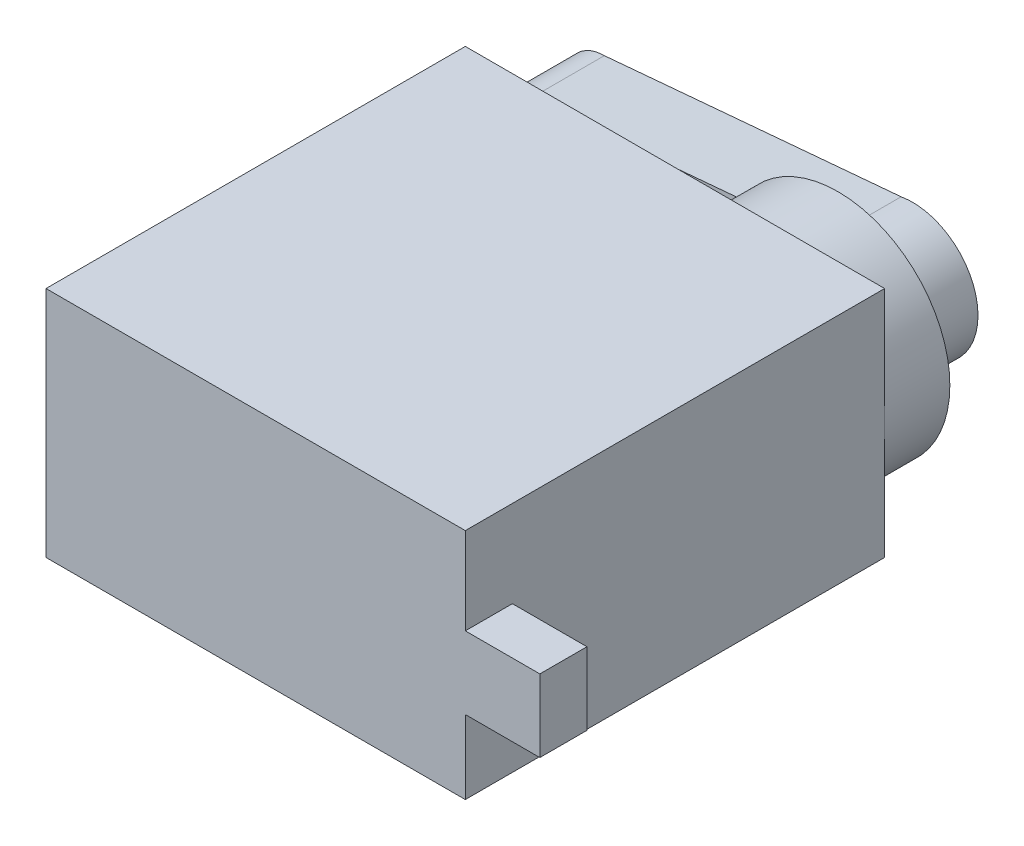
ISO-10303-21;
HEADER;
FILE_DESCRIPTION(('STEP AP214'),'2;1');
FILE_NAME('part.step','',(''),(''),'','','');
FILE_SCHEMA(('AUTOMOTIVE_DESIGN { 1 0 10303 214 1 1 1 1 }'));
ENDSEC;
DATA;
#1=APPLICATION_CONTEXT('core data for automotive mechanical design processes');
#2=APPLICATION_PROTOCOL_DEFINITION('international standard','automotive_design',2000,#1);
#3=PRODUCT_CONTEXT('',#1,'mechanical');
#4=PRODUCT('Part','Part','',(#3));
#5=PRODUCT_RELATED_PRODUCT_CATEGORY('part','',(#4));
#6=PRODUCT_DEFINITION_FORMATION('','',#4);
#7=PRODUCT_DEFINITION_CONTEXT('part definition',#1,'design');
#8=PRODUCT_DEFINITION('design','',#6,#7);
#9=PRODUCT_DEFINITION_SHAPE('','',#8);
#10=(LENGTH_UNIT() NAMED_UNIT(*) SI_UNIT(.MILLI.,.METRE.));
#11=(NAMED_UNIT(*) PLANE_ANGLE_UNIT() SI_UNIT($,.RADIAN.));
#12=(NAMED_UNIT(*) SI_UNIT($,.STERADIAN.) SOLID_ANGLE_UNIT());
#13=UNCERTAINTY_MEASURE_WITH_UNIT(LENGTH_MEASURE(1.E-05),#10,'distance_accuracy_value','');
#14=(GEOMETRIC_REPRESENTATION_CONTEXT(3) GLOBAL_UNCERTAINTY_ASSIGNED_CONTEXT((#13)) GLOBAL_UNIT_ASSIGNED_CONTEXT((#10,
#11,#12)) REPRESENTATION_CONTEXT('',''));
#15=CARTESIAN_POINT('',(0.,0.,0.));
#16=DIRECTION('',(0.,0.,1.));
#17=DIRECTION('',(1.,0.,0.));
#18=AXIS2_PLACEMENT_3D('',#15,#16,#17);
#19=CARTESIAN_POINT('',(11.25,6.25,22.5));
#20=DIRECTION('',(-1.,0.,0.));
#21=DIRECTION('',(0.,-1.,0.));
#22=AXIS2_PLACEMENT_3D('',#19,#20,#21);
#23=PLANE('',#22);
#24=DIRECTION('',(0.,0.,-1.));
#25=VECTOR('',#24,1.);
#26=CARTESIAN_POINT('',(11.25,-2.29734072769361,22.5));
#27=LINE('',#26,#25);
#28=CARTESIAN_POINT('',(11.25,-2.29734072769361,22.5));
#29=VERTEX_POINT('',#28);
#30=CARTESIAN_POINT('',(11.25,-2.29734072769361,19.9739061693691));
#31=VERTEX_POINT('',#30);
#32=EDGE_CURVE('E246',#29,#31,#27,.T.);
#33=ORIENTED_EDGE('',*,*,#32,.F.);
#34=DIRECTION('',(0.,1.,0.));
#35=VECTOR('',#34,1.);
#36=CARTESIAN_POINT('',(11.25,6.25,22.5));
#37=LINE('',#36,#35);
#38=CARTESIAN_POINT('',(11.25,-6.25,22.5));
#39=VERTEX_POINT('',#38);
#40=EDGE_CURVE('E155',#39,#29,#37,.T.);
#41=ORIENTED_EDGE('',*,*,#40,.F.);
#42=DIRECTION('',(0.,0.,-1.));
#43=VECTOR('',#42,1.);
#44=CARTESIAN_POINT('',(11.25,-6.25,22.5));
#45=LINE('',#44,#43);
#46=CARTESIAN_POINT('',(11.25,-6.25,0.));
#47=VERTEX_POINT('',#46);
#48=EDGE_CURVE('E205',#39,#47,#45,.T.);
#49=ORIENTED_EDGE('',*,*,#48,.T.);
#50=DIRECTION('',(0.,1.,0.));
#51=VECTOR('',#50,1.);
#52=CARTESIAN_POINT('',(11.25,6.25,0.));
#53=LINE('',#52,#51);
#54=CARTESIAN_POINT('',(11.25,0.,0.));
#55=VERTEX_POINT('',#54);
#56=EDGE_CURVE('E206',#47,#55,#53,.T.);
#57=ORIENTED_EDGE('',*,*,#56,.T.);
#58=CARTESIAN_POINT('',(11.25,6.25,0.));
#59=VERTEX_POINT('',#58);
#60=EDGE_CURVE('E193',#55,#59,#53,.T.);
#61=ORIENTED_EDGE('',*,*,#60,.T.);
#62=DIRECTION('',(0.,0.,-1.));
#63=VECTOR('',#62,1.);
#64=CARTESIAN_POINT('',(11.25,6.25,22.5));
#65=LINE('',#64,#63);
#66=CARTESIAN_POINT('',(11.25,6.25,22.5));
#67=VERTEX_POINT('',#66);
#68=EDGE_CURVE('E37',#67,#59,#65,.T.);
#69=ORIENTED_EDGE('',*,*,#68,.F.);
#70=CARTESIAN_POINT('',(11.25,1.59067430024606,22.5));
#71=VERTEX_POINT('',#70);
#72=EDGE_CURVE('E199',#71,#67,#37,.T.);
#73=ORIENTED_EDGE('',*,*,#72,.F.);
#74=DIRECTION('',(0.,0.,1.));
#75=VECTOR('',#74,1.);
#76=CARTESIAN_POINT('',(11.25,1.59067430024606,22.5));
#77=LINE('',#76,#75);
#78=CARTESIAN_POINT('',(11.25,1.59067430024606,19.9739061693691));
#79=VERTEX_POINT('',#78);
#80=EDGE_CURVE('E150',#79,#71,#77,.T.);
#81=ORIENTED_EDGE('',*,*,#80,.F.);
#82=DIRECTION('',(0.,1.,0.));
#83=VECTOR('',#82,1.);
#84=CARTESIAN_POINT('',(11.25,1.59067430024606,19.9739061693691));
#85=LINE('',#84,#83);
#86=EDGE_CURVE('E247',#31,#79,#85,.T.);
#87=ORIENTED_EDGE('',*,*,#86,.F.);
#88=EDGE_LOOP('',(#33,#41,#49,#57,#61,#69,#73,#81,#87));
#89=FACE_BOUND('',#88,.T.);
#90=ADVANCED_FACE('F34',(#89),#23,.F.);
#91=CARTESIAN_POINT('',(-11.25,6.25,22.5));
#92=DIRECTION('',(0.,-1.,0.));
#93=DIRECTION('',(0.,0.,-1.));
#94=AXIS2_PLACEMENT_3D('',#91,#92,#93);
#95=PLANE('',#94);
#96=DIRECTION('',(-1.,0.,0.));
#97=VECTOR('',#96,1.);
#98=CARTESIAN_POINT('',(-11.25,6.25,0.));
#99=LINE('',#98,#97);
#100=CARTESIAN_POINT('',(-11.25,6.25,0.));
#101=VERTEX_POINT('',#100);
#102=EDGE_CURVE('E208',#59,#101,#99,.T.);
#103=ORIENTED_EDGE('',*,*,#102,.T.);
#104=DIRECTION('',(0.,0.,-1.));
#105=VECTOR('',#104,1.);
#106=CARTESIAN_POINT('',(-11.25,6.25,22.5));
#107=LINE('',#106,#105);
#108=CARTESIAN_POINT('',(-11.25,6.25,22.5));
#109=VERTEX_POINT('',#108);
#110=EDGE_CURVE('E218',#109,#101,#107,.T.);
#111=ORIENTED_EDGE('',*,*,#110,.F.);
#112=DIRECTION('',(-1.,0.,0.));
#113=VECTOR('',#112,1.);
#114=CARTESIAN_POINT('',(-11.25,6.25,22.5));
#115=LINE('',#114,#113);
#116=EDGE_CURVE('E198',#67,#109,#115,.T.);
#117=ORIENTED_EDGE('',*,*,#116,.F.);
#118=ORIENTED_EDGE('',*,*,#68,.T.);
#119=EDGE_LOOP('',(#103,#111,#117,#118));
#120=FACE_BOUND('',#119,.T.);
#121=ADVANCED_FACE('F228',(#120),#95,.F.);
#122=CARTESIAN_POINT('',(-11.25,6.25,22.5));
#123=DIRECTION('',(1.,0.,0.));
#124=DIRECTION('',(0.,1.,0.));
#125=AXIS2_PLACEMENT_3D('',#122,#123,#124);
#126=PLANE('',#125);
#127=DIRECTION('',(0.,-1.,0.));
#128=VECTOR('',#127,1.);
#129=CARTESIAN_POINT('',(-11.25,6.25,0.));
#130=LINE('',#129,#128);
#131=CARTESIAN_POINT('',(-11.25,-6.25,0.));
#132=VERTEX_POINT('',#131);
#133=EDGE_CURVE('E210',#101,#132,#130,.T.);
#134=ORIENTED_EDGE('',*,*,#133,.T.);
#135=DIRECTION('',(0.,0.,-1.));
#136=VECTOR('',#135,1.);
#137=CARTESIAN_POINT('',(-11.25,-6.25,22.5));
#138=LINE('',#137,#136);
#139=CARTESIAN_POINT('',(-11.25,-6.25,22.5));
#140=VERTEX_POINT('',#139);
#141=EDGE_CURVE('E216',#140,#132,#138,.T.);
#142=ORIENTED_EDGE('',*,*,#141,.F.);
#143=DIRECTION('',(0.,-1.,0.));
#144=VECTOR('',#143,1.);
#145=CARTESIAN_POINT('',(-11.25,6.25,22.5));
#146=LINE('',#145,#144);
#147=EDGE_CURVE('E201',#109,#140,#146,.T.);
#148=ORIENTED_EDGE('',*,*,#147,.F.);
#149=ORIENTED_EDGE('',*,*,#110,.T.);
#150=EDGE_LOOP('',(#134,#142,#148,#149));
#151=FACE_BOUND('',#150,.T.);
#152=ADVANCED_FACE('F240',(#151),#126,.F.);
#153=CARTESIAN_POINT('',(-11.25,-6.25,22.5));
#154=DIRECTION('',(0.,1.,0.));
#155=DIRECTION('',(0.,0.,1.));
#156=AXIS2_PLACEMENT_3D('',#153,#154,#155);
#157=PLANE('',#156);
#158=DIRECTION('',(1.,0.,0.));
#159=VECTOR('',#158,1.);
#160=CARTESIAN_POINT('',(-11.25,-6.25,0.));
#161=LINE('',#160,#159);
#162=EDGE_CURVE('E212',#132,#47,#161,.T.);
#163=ORIENTED_EDGE('',*,*,#162,.T.);
#164=ORIENTED_EDGE('',*,*,#48,.F.);
#165=DIRECTION('',(1.,0.,0.));
#166=VECTOR('',#165,1.);
#167=CARTESIAN_POINT('',(-11.25,-6.25,22.5));
#168=LINE('',#167,#166);
#169=EDGE_CURVE('E203',#140,#39,#168,.T.);
#170=ORIENTED_EDGE('',*,*,#169,.F.);
#171=ORIENTED_EDGE('',*,*,#141,.T.);
#172=EDGE_LOOP('',(#163,#164,#170,#171));
#173=FACE_BOUND('',#172,.T.);
#174=ADVANCED_FACE('F243',(#173),#157,.F.);
#175=CARTESIAN_POINT('',(0.,0.,22.5));
#176=DIRECTION('',(0.,0.,1.));
#177=DIRECTION('',(1.,0.,0.));
#178=AXIS2_PLACEMENT_3D('',#175,#176,#177);
#179=PLANE('',#178);
#180=ORIENTED_EDGE('',*,*,#40,.T.);
#181=DIRECTION('',(-1.,0.,0.));
#182=VECTOR('',#181,1.);
#183=CARTESIAN_POINT('',(15.25,-2.29734072769361,22.5));
#184=LINE('',#183,#182);
#185=CARTESIAN_POINT('',(15.25,-2.29734072769361,22.5));
#186=VERTEX_POINT('',#185);
#187=EDGE_CURVE('E138',#186,#29,#184,.T.);
#188=ORIENTED_EDGE('',*,*,#187,.F.);
#189=DIRECTION('',(0.,-1.,0.));
#190=VECTOR('',#189,1.);
#191=CARTESIAN_POINT('',(15.25,1.59067430024606,22.5));
#192=LINE('',#191,#190);
#193=CARTESIAN_POINT('',(15.25,1.59067430024606,22.5));
#194=VERTEX_POINT('',#193);
#195=EDGE_CURVE('E145',#194,#186,#192,.T.);
#196=ORIENTED_EDGE('',*,*,#195,.F.);
#197=DIRECTION('',(-1.,0.,0.));
#198=VECTOR('',#197,1.);
#199=CARTESIAN_POINT('',(15.25,1.59067430024606,22.5));
#200=LINE('',#199,#198);
#201=EDGE_CURVE('E50',#194,#71,#200,.T.);
#202=ORIENTED_EDGE('',*,*,#201,.T.);
#203=ORIENTED_EDGE('',*,*,#72,.T.);
#204=ORIENTED_EDGE('',*,*,#116,.T.);
#205=ORIENTED_EDGE('',*,*,#147,.T.);
#206=ORIENTED_EDGE('',*,*,#169,.T.);
#207=EDGE_LOOP('',(#180,#188,#196,#202,#203,#204,#205,#206));
#208=FACE_BOUND('',#207,.T.);
#209=ADVANCED_FACE('F153',(#208),#179,.T.);
#210=CARTESIAN_POINT('',(0.,0.,0.));
#211=DIRECTION('',(0.,0.,1.));
#212=DIRECTION('',(1.,0.,0.));
#213=AXIS2_PLACEMENT_3D('',#210,#211,#212);
#214=PLANE('',#213);
#215=ORIENTED_EDGE('',*,*,#60,.F.);
#216=CARTESIAN_POINT('',(5.25,0.,0.));
#217=DIRECTION('',(0.,0.,-1.));
#218=DIRECTION('',(-1.,0.,0.));
#219=AXIS2_PLACEMENT_3D('',#216,#217,#218);
#220=CIRCLE('',#219,6.);
#221=EDGE_CURVE('E190',#55,#55,#220,.T.);
#222=ORIENTED_EDGE('',*,*,#221,.F.);
#223=ORIENTED_EDGE('',*,*,#56,.F.);
#224=ORIENTED_EDGE('',*,*,#162,.F.);
#225=ORIENTED_EDGE('',*,*,#133,.F.);
#226=ORIENTED_EDGE('',*,*,#102,.F.);
#227=EDGE_LOOP('',(#215,#222,#223,#224,#225,#226));
#228=FACE_BOUND('',#227,.T.);
#229=ADVANCED_FACE('F237',(#228),#214,.F.);
#230=CARTESIAN_POINT('',(5.25,0.,-3.5));
#231=DIRECTION('',(0.,0.,1.));
#232=DIRECTION('',(1.,0.,0.));
#233=AXIS2_PLACEMENT_3D('',#230,#231,#232);
#234=CYLINDRICAL_SURFACE('',#233,6.);
#235=CARTESIAN_POINT('',(5.25,0.,-3.5));
#236=DIRECTION('',(0.,0.,-1.));
#237=DIRECTION('',(-1.,0.,0.));
#238=AXIS2_PLACEMENT_3D('',#235,#236,#237);
#239=CIRCLE('',#238,6.);
#240=CARTESIAN_POINT('',(0.0854735122375189,3.0541228130512,-3.5));
#241=VERTEX_POINT('',#240);
#242=CARTESIAN_POINT('',(0.085473512237518,-3.0541228130512,-3.5));
#243=VERTEX_POINT('',#242);
#244=EDGE_CURVE('E191',#241,#243,#239,.T.);
#245=ORIENTED_EDGE('',*,*,#244,.F.);
#246=EDGE_CURVE('E194',#243,#241,#239,.T.);
#247=ORIENTED_EDGE('',*,*,#246,.F.);
#248=EDGE_LOOP('',(#245,#247));
#249=FACE_BOUND('',#248,.T.);
#250=ORIENTED_EDGE('',*,*,#221,.T.);
#251=EDGE_LOOP('',(#250));
#252=FACE_BOUND('',#251,.T.);
#253=ADVANCED_FACE('F282',(#249,#252),#234,.T.);
#254=CARTESIAN_POINT('',(0.,0.,-3.5));
#255=DIRECTION('',(0.,0.,-1.));
#256=DIRECTION('',(-1.,0.,0.));
#257=AXIS2_PLACEMENT_3D('',#254,#255,#256);
#258=PLANE('',#257);
#259=DIRECTION('',(-0.996126747672036,0.0879289632165159,0.));
#260=VECTOR('',#259,1.);
#261=CARTESIAN_POINT('',(-11.29,-2.05,-3.5));
#262=LINE('',#261,#260);
#263=CARTESIAN_POINT('',(4.63512948707161,-3.45572485194223,-3.5));
#264=VERTEX_POINT('',#263);
#265=EDGE_CURVE('E58',#264,#243,#262,.T.);
#266=ORIENTED_EDGE('',*,*,#265,.F.);
#267=CARTESIAN_POINT('',(5.25,0.,-3.5));
#268=DIRECTION('',(0.,0.,-1.));
#269=DIRECTION('',(-1.,0.,0.));
#270=AXIS2_PLACEMENT_3D('',#267,#268,#269);
#271=CIRCLE('',#270,3.51);
#272=CARTESIAN_POINT('',(4.6351294870716,3.45572485194223,-3.5));
#273=VERTEX_POINT('',#272);
#274=EDGE_CURVE('E175',#273,#264,#271,.T.);
#275=ORIENTED_EDGE('',*,*,#274,.F.);
#276=DIRECTION('',(0.996126747672036,0.0879289632165159,0.));
#277=VECTOR('',#276,1.);
#278=CARTESIAN_POINT('',(4.6351294870716,3.45572485194223,-3.5));
#279=LINE('',#278,#277);
#280=EDGE_CURVE('E11',#241,#273,#279,.T.);
#281=ORIENTED_EDGE('',*,*,#280,.F.);
#282=ORIENTED_EDGE('',*,*,#244,.T.);
#283=EDGE_LOOP('',(#266,#275,#281,#282));
#284=FACE_BOUND('',#283,.T.);
#285=ADVANCED_FACE('F287',(#284),#258,.T.);
#286=CARTESIAN_POINT('',(-11.29,0.,-3.5));
#287=DIRECTION('',(0.,0.,-1.));
#288=DIRECTION('',(-1.,0.,0.));
#289=AXIS2_PLACEMENT_3D('',#286,#287,#288);
#290=PLANE('',#289);
#291=CARTESIAN_POINT('',(-11.29,-2.05,-3.5));
#292=VERTEX_POINT('',#291);
#293=EDGE_CURVE('E177',#243,#292,#262,.T.);
#294=ORIENTED_EDGE('',*,*,#293,.F.);
#295=ORIENTED_EDGE('',*,*,#246,.T.);
#296=CARTESIAN_POINT('',(-11.29,2.05,-3.5));
#297=VERTEX_POINT('',#296);
#298=EDGE_CURVE('E43',#297,#241,#279,.T.);
#299=ORIENTED_EDGE('',*,*,#298,.F.);
#300=CARTESIAN_POINT('',(-11.29,0.,-3.5));
#301=DIRECTION('',(0.,0.,-1.));
#302=DIRECTION('',(-1.,0.,0.));
#303=AXIS2_PLACEMENT_3D('',#300,#301,#302);
#304=CIRCLE('',#303,2.05);
#305=EDGE_CURVE('E156',#292,#297,#304,.T.);
#306=ORIENTED_EDGE('',*,*,#305,.F.);
#307=EDGE_LOOP('',(#294,#295,#299,#306));
#308=FACE_BOUND('',#307,.T.);
#309=ADVANCED_FACE('F291',(#308),#290,.F.);
#310=CARTESIAN_POINT('',(-11.29,0.,-7.5));
#311=DIRECTION('',(0.,0.,1.));
#312=DIRECTION('',(1.,0.,0.));
#313=AXIS2_PLACEMENT_3D('',#310,#311,#312);
#314=CYLINDRICAL_SURFACE('',#313,2.05);
#315=ORIENTED_EDGE('',*,*,#305,.T.);
#316=DIRECTION('',(0.,0.,1.));
#317=VECTOR('',#316,1.);
#318=CARTESIAN_POINT('',(-11.29,2.05,-7.5));
#319=LINE('',#318,#317);
#320=CARTESIAN_POINT('',(-11.29,2.05,-7.5));
#321=VERTEX_POINT('',#320);
#322=EDGE_CURVE('E187',#321,#297,#319,.T.);
#323=ORIENTED_EDGE('',*,*,#322,.F.);
#324=CARTESIAN_POINT('',(-11.29,0.,-7.5));
#325=DIRECTION('',(0.,0.,-1.));
#326=DIRECTION('',(-1.,0.,0.));
#327=AXIS2_PLACEMENT_3D('',#324,#325,#326);
#328=CIRCLE('',#327,2.05);
#329=CARTESIAN_POINT('',(-11.29,-2.05,-7.5));
#330=VERTEX_POINT('',#329);
#331=EDGE_CURVE('E164',#330,#321,#328,.T.);
#332=ORIENTED_EDGE('',*,*,#331,.F.);
#333=DIRECTION('',(0.,0.,1.));
#334=VECTOR('',#333,1.);
#335=CARTESIAN_POINT('',(-11.29,-2.05,-7.5));
#336=LINE('',#335,#334);
#337=EDGE_CURVE('E172',#330,#292,#336,.T.);
#338=ORIENTED_EDGE('',*,*,#337,.T.);
#339=EDGE_LOOP('',(#315,#323,#332,#338));
#340=FACE_BOUND('',#339,.T.);
#341=ADVANCED_FACE('F292',(#340),#314,.T.);
#342=CARTESIAN_POINT('',(4.6351294870716,3.45572485194223,-7.5));
#343=DIRECTION('',(0.0879289632165158,-0.996126747672036,0.));
#344=DIRECTION('',(0.996126747672036,0.0879289632165158,0.));
#345=AXIS2_PLACEMENT_3D('',#342,#343,#344);
#346=PLANE('',#345);
#347=ORIENTED_EDGE('',*,*,#298,.T.);
#348=ORIENTED_EDGE('',*,*,#280,.T.);
#349=DIRECTION('',(0.,0.,1.));
#350=VECTOR('',#349,1.);
#351=CARTESIAN_POINT('',(4.6351294870716,3.45572485194223,-7.5));
#352=LINE('',#351,#350);
#353=CARTESIAN_POINT('',(4.6351294870716,3.45572485194223,-7.5));
#354=VERTEX_POINT('',#353);
#355=EDGE_CURVE('E184',#354,#273,#352,.T.);
#356=ORIENTED_EDGE('',*,*,#355,.F.);
#357=DIRECTION('',(0.996126747672036,0.0879289632165159,0.));
#358=VECTOR('',#357,1.);
#359=CARTESIAN_POINT('',(4.6351294870716,3.45572485194223,-7.5));
#360=LINE('',#359,#358);
#361=EDGE_CURVE('E167',#321,#354,#360,.T.);
#362=ORIENTED_EDGE('',*,*,#361,.F.);
#363=ORIENTED_EDGE('',*,*,#322,.T.);
#364=EDGE_LOOP('',(#347,#348,#356,#362,#363));
#365=FACE_BOUND('',#364,.T.);
#366=ADVANCED_FACE('F295',(#365),#346,.F.);
#367=CARTESIAN_POINT('',(5.25,0.,-7.5));
#368=DIRECTION('',(0.,0.,1.));
#369=DIRECTION('',(1.,0.,0.));
#370=AXIS2_PLACEMENT_3D('',#367,#368,#369);
#371=CYLINDRICAL_SURFACE('',#370,3.51);
#372=ORIENTED_EDGE('',*,*,#274,.T.);
#373=DIRECTION('',(0.,0.,1.));
#374=VECTOR('',#373,1.);
#375=CARTESIAN_POINT('',(4.63512948707161,-3.45572485194223,-7.5));
#376=LINE('',#375,#374);
#377=CARTESIAN_POINT('',(4.63512948707161,-3.45572485194223,-7.5));
#378=VERTEX_POINT('',#377);
#379=EDGE_CURVE('E181',#378,#264,#376,.T.);
#380=ORIENTED_EDGE('',*,*,#379,.F.);
#381=CARTESIAN_POINT('',(5.25,0.,-7.5));
#382=DIRECTION('',(0.,0.,-1.));
#383=DIRECTION('',(-1.,0.,0.));
#384=AXIS2_PLACEMENT_3D('',#381,#382,#383);
#385=CIRCLE('',#384,3.51);
#386=EDGE_CURVE('E169',#354,#378,#385,.T.);
#387=ORIENTED_EDGE('',*,*,#386,.F.);
#388=ORIENTED_EDGE('',*,*,#355,.T.);
#389=EDGE_LOOP('',(#372,#380,#387,#388));
#390=FACE_BOUND('',#389,.T.);
#391=ADVANCED_FACE('F299',(#390),#371,.T.);
#392=CARTESIAN_POINT('',(-11.29,-2.05,-7.5));
#393=DIRECTION('',(0.0879289632165159,0.996126747672036,0.));
#394=DIRECTION('',(-0.996126747672036,0.0879289632165159,0.));
#395=AXIS2_PLACEMENT_3D('',#392,#393,#394);
#396=PLANE('',#395);
#397=ORIENTED_EDGE('',*,*,#265,.T.);
#398=ORIENTED_EDGE('',*,*,#293,.T.);
#399=ORIENTED_EDGE('',*,*,#337,.F.);
#400=DIRECTION('',(-0.996126747672036,0.0879289632165159,0.));
#401=VECTOR('',#400,1.);
#402=CARTESIAN_POINT('',(-11.29,-2.05,-7.5));
#403=LINE('',#402,#401);
#404=EDGE_CURVE('E171',#378,#330,#403,.T.);
#405=ORIENTED_EDGE('',*,*,#404,.F.);
#406=ORIENTED_EDGE('',*,*,#379,.T.);
#407=EDGE_LOOP('',(#397,#398,#399,#405,#406));
#408=FACE_BOUND('',#407,.T.);
#409=ADVANCED_FACE('F303',(#408),#396,.F.);
#410=CARTESIAN_POINT('',(-11.29,0.,-7.5));
#411=DIRECTION('',(0.,0.,-1.));
#412=DIRECTION('',(-1.,0.,0.));
#413=AXIS2_PLACEMENT_3D('',#410,#411,#412);
#414=PLANE('',#413);
#415=ORIENTED_EDGE('',*,*,#331,.T.);
#416=ORIENTED_EDGE('',*,*,#361,.T.);
#417=ORIENTED_EDGE('',*,*,#386,.T.);
#418=ORIENTED_EDGE('',*,*,#404,.T.);
#419=EDGE_LOOP('',(#415,#416,#417,#418));
#420=FACE_BOUND('',#419,.T.);
#421=ADVANCED_FACE('F267',(#420),#414,.T.);
#422=CARTESIAN_POINT('',(15.25,-2.29734072769361,22.5));
#423=DIRECTION('',(0.,1.,0.));
#424=DIRECTION('',(-1.,0.,0.));
#425=AXIS2_PLACEMENT_3D('',#422,#423,#424);
#426=PLANE('',#425);
#427=ORIENTED_EDGE('',*,*,#32,.T.);
#428=DIRECTION('',(-1.,0.,0.));
#429=VECTOR('',#428,1.);
#430=CARTESIAN_POINT('',(15.25,-2.29734072769361,19.9739061693691));
#431=LINE('',#430,#429);
#432=CARTESIAN_POINT('',(15.25,-2.29734072769361,19.9739061693691));
#433=VERTEX_POINT('',#432);
#434=EDGE_CURVE('E141',#433,#31,#431,.T.);
#435=ORIENTED_EDGE('',*,*,#434,.F.);
#436=DIRECTION('',(0.,0.,-1.));
#437=VECTOR('',#436,1.);
#438=CARTESIAN_POINT('',(15.25,-2.29734072769361,22.5));
#439=LINE('',#438,#437);
#440=EDGE_CURVE('E134',#186,#433,#439,.T.);
#441=ORIENTED_EDGE('',*,*,#440,.F.);
#442=ORIENTED_EDGE('',*,*,#187,.T.);
#443=EDGE_LOOP('',(#427,#435,#441,#442));
#444=FACE_BOUND('',#443,.T.);
#445=ADVANCED_FACE('F136',(#444),#426,.F.);
#446=CARTESIAN_POINT('',(15.25,1.59067430024606,19.9739061693691));
#447=DIRECTION('',(0.,0.,1.));
#448=DIRECTION('',(1.,0.,0.));
#449=AXIS2_PLACEMENT_3D('',#446,#447,#448);
#450=PLANE('',#449);
#451=ORIENTED_EDGE('',*,*,#86,.T.);
#452=DIRECTION('',(-1.,0.,0.));
#453=VECTOR('',#452,1.);
#454=CARTESIAN_POINT('',(15.25,1.59067430024606,19.9739061693691));
#455=LINE('',#454,#453);
#456=CARTESIAN_POINT('',(15.25,1.59067430024606,19.9739061693691));
#457=VERTEX_POINT('',#456);
#458=EDGE_CURVE('E160',#457,#79,#455,.T.);
#459=ORIENTED_EDGE('',*,*,#458,.F.);
#460=DIRECTION('',(0.,1.,0.));
#461=VECTOR('',#460,1.);
#462=CARTESIAN_POINT('',(15.25,1.59067430024606,19.9739061693691));
#463=LINE('',#462,#461);
#464=EDGE_CURVE('E144',#433,#457,#463,.T.);
#465=ORIENTED_EDGE('',*,*,#464,.F.);
#466=ORIENTED_EDGE('',*,*,#434,.T.);
#467=EDGE_LOOP('',(#451,#459,#465,#466));
#468=FACE_BOUND('',#467,.T.);
#469=ADVANCED_FACE('F259',(#468),#450,.F.);
#470=CARTESIAN_POINT('',(15.25,1.59067430024606,22.5));
#471=DIRECTION('',(0.,-1.,0.));
#472=DIRECTION('',(1.,0.,0.));
#473=AXIS2_PLACEMENT_3D('',#470,#471,#472);
#474=PLANE('',#473);
#475=ORIENTED_EDGE('',*,*,#80,.T.);
#476=ORIENTED_EDGE('',*,*,#201,.F.);
#477=DIRECTION('',(0.,0.,1.));
#478=VECTOR('',#477,1.);
#479=CARTESIAN_POINT('',(15.25,1.59067430024606,22.5));
#480=LINE('',#479,#478);
#481=EDGE_CURVE('E149',#457,#194,#480,.T.);
#482=ORIENTED_EDGE('',*,*,#481,.F.);
#483=ORIENTED_EDGE('',*,*,#458,.T.);
#484=EDGE_LOOP('',(#475,#476,#482,#483));
#485=FACE_BOUND('',#484,.T.);
#486=ADVANCED_FACE('F257',(#485),#474,.F.);
#487=CARTESIAN_POINT('',(15.25,0.,0.));
#488=DIRECTION('',(1.,0.,0.));
#489=DIRECTION('',(0.,0.,-1.));
#490=AXIS2_PLACEMENT_3D('',#487,#488,#489);
#491=PLANE('',#490);
#492=ORIENTED_EDGE('',*,*,#195,.T.);
#493=ORIENTED_EDGE('',*,*,#440,.T.);
#494=ORIENTED_EDGE('',*,*,#464,.T.);
#495=ORIENTED_EDGE('',*,*,#481,.T.);
#496=EDGE_LOOP('',(#492,#493,#494,#495));
#497=FACE_BOUND('',#496,.T.);
#498=ADVANCED_FACE('F147',(#497),#491,.T.);
#499=CLOSED_SHELL('',(#90,#121,#152,#174,#209,#229,#253,#285,#309,#341,#366,#391,#409,#421,#445,
#469,#486,#498));
#500=MANIFOLD_SOLID_BREP('B2',#499);
#501=ADVANCED_BREP_SHAPE_REPRESENTATION('',(#18,#500),#14);
#502=SHAPE_DEFINITION_REPRESENTATION(#9,#501);
ENDSEC;
END-ISO-10303-21;
